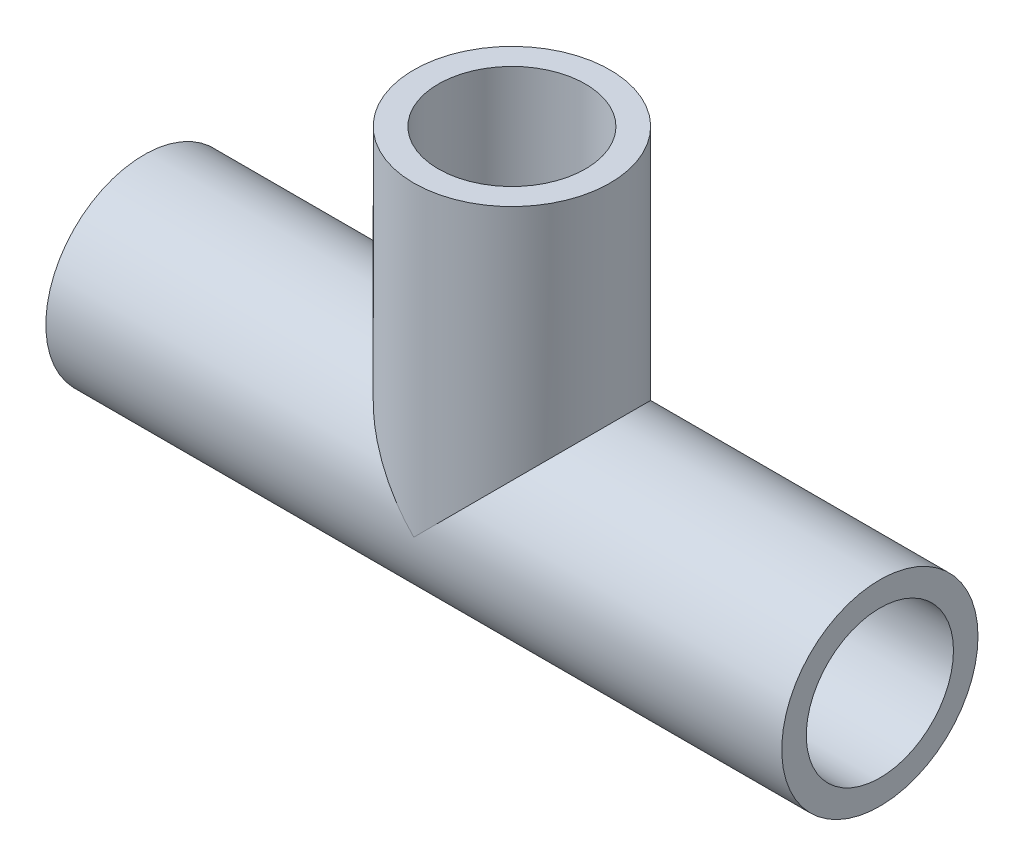
ISO-10303-21;
HEADER;
FILE_DESCRIPTION(('STEP AP214'),'2;1');
FILE_NAME('part.step','',(''),(''),'','','');
FILE_SCHEMA(('AUTOMOTIVE_DESIGN { 1 0 10303 214 1 1 1 1 }'));
ENDSEC;
DATA;
#1=APPLICATION_CONTEXT('core data for automotive mechanical design processes');
#2=APPLICATION_PROTOCOL_DEFINITION('international standard','automotive_design',2000,#1);
#3=PRODUCT_CONTEXT('',#1,'mechanical');
#4=PRODUCT('Part','Part','',(#3));
#5=PRODUCT_RELATED_PRODUCT_CATEGORY('part','',(#4));
#6=PRODUCT_DEFINITION_FORMATION('','',#4);
#7=PRODUCT_DEFINITION_CONTEXT('part definition',#1,'design');
#8=PRODUCT_DEFINITION('design','',#6,#7);
#9=PRODUCT_DEFINITION_SHAPE('','',#8);
#10=(LENGTH_UNIT() NAMED_UNIT(*) SI_UNIT(.MILLI.,.METRE.));
#11=(NAMED_UNIT(*) PLANE_ANGLE_UNIT() SI_UNIT($,.RADIAN.));
#12=(NAMED_UNIT(*) SI_UNIT($,.STERADIAN.) SOLID_ANGLE_UNIT());
#13=UNCERTAINTY_MEASURE_WITH_UNIT(LENGTH_MEASURE(1.E-05),#10,'distance_accuracy_value','');
#14=(GEOMETRIC_REPRESENTATION_CONTEXT(3) GLOBAL_UNCERTAINTY_ASSIGNED_CONTEXT((#13)) GLOBAL_UNIT_ASSIGNED_CONTEXT((#10,
#11,#12)) REPRESENTATION_CONTEXT('',''));
#15=CARTESIAN_POINT('',(0.,0.,0.));
#16=DIRECTION('',(0.,0.,1.));
#17=DIRECTION('',(1.,0.,0.));
#18=AXIS2_PLACEMENT_3D('',#15,#16,#17);
#19=CARTESIAN_POINT('',(30.,0.,0.));
#20=DIRECTION('',(1.,0.,0.));
#21=DIRECTION('',(0.,0.,-1.));
#22=AXIS2_PLACEMENT_3D('',#19,#20,#21);
#23=PLANE('',#22);
#24=CARTESIAN_POINT('',(30.,0.,0.));
#25=DIRECTION('',(1.,0.,0.));
#26=DIRECTION('',(0.,0.,-1.));
#27=AXIS2_PLACEMENT_3D('',#24,#25,#26);
#28=CIRCLE('',#27,8.);
#29=CARTESIAN_POINT('',(30.,0.,-8.));
#30=VERTEX_POINT('',#29);
#31=EDGE_CURVE('E11',#30,#30,#28,.T.);
#32=ORIENTED_EDGE('',*,*,#31,.T.);
#33=EDGE_LOOP('',(#32));
#34=FACE_BOUND('',#33,.T.);
#35=CARTESIAN_POINT('',(30.,0.,0.));
#36=DIRECTION('',(1.,0.,0.));
#37=DIRECTION('',(0.,0.,-1.));
#38=AXIS2_PLACEMENT_3D('',#35,#36,#37);
#39=CIRCLE('',#38,6.);
#40=CARTESIAN_POINT('',(30.,0.,-6.));
#41=VERTEX_POINT('',#40);
#42=EDGE_CURVE('E89',#41,#41,#39,.T.);
#43=ORIENTED_EDGE('',*,*,#42,.F.);
#44=EDGE_LOOP('',(#43));
#45=FACE_BOUND('',#44,.T.);
#46=ADVANCED_FACE('F39',(#34,#45),#23,.T.);
#47=CARTESIAN_POINT('',(-30.,0.,0.));
#48=DIRECTION('',(1.,0.,0.));
#49=DIRECTION('',(0.,0.,-1.));
#50=AXIS2_PLACEMENT_3D('',#47,#48,#49);
#51=PLANE('',#50);
#52=CARTESIAN_POINT('',(-30.,0.,0.));
#53=DIRECTION('',(1.,0.,0.));
#54=DIRECTION('',(0.,0.,-1.));
#55=AXIS2_PLACEMENT_3D('',#52,#53,#54);
#56=CIRCLE('',#55,8.);
#57=CARTESIAN_POINT('',(-30.,0.,-8.));
#58=VERTEX_POINT('',#57);
#59=EDGE_CURVE('E43',#58,#58,#56,.T.);
#60=ORIENTED_EDGE('',*,*,#59,.F.);
#61=EDGE_LOOP('',(#60));
#62=FACE_BOUND('',#61,.T.);
#63=CARTESIAN_POINT('',(-30.,0.,0.));
#64=DIRECTION('',(1.,0.,0.));
#65=DIRECTION('',(0.,0.,-1.));
#66=AXIS2_PLACEMENT_3D('',#63,#64,#65);
#67=CIRCLE('',#66,6.);
#68=CARTESIAN_POINT('',(-30.,0.,-6.));
#69=VERTEX_POINT('',#68);
#70=EDGE_CURVE('E87',#69,#69,#67,.T.);
#71=ORIENTED_EDGE('',*,*,#70,.T.);
#72=EDGE_LOOP('',(#71));
#73=FACE_BOUND('',#72,.T.);
#74=ADVANCED_FACE('F97',(#62,#73),#51,.F.);
#75=CARTESIAN_POINT('',(30.,0.,0.));
#76=DIRECTION('',(-1.,0.,0.));
#77=DIRECTION('',(0.,0.,1.));
#78=AXIS2_PLACEMENT_3D('',#75,#76,#77);
#79=CYLINDRICAL_SURFACE('',#78,8.);
#80=CARTESIAN_POINT('',(0.,0.,0.));
#81=DIRECTION('',(0.707106781186547,0.707106781186547,0.));
#82=DIRECTION('',(-0.707106781186547,0.707106781186547,0.));
#83=AXIS2_PLACEMENT_3D('',#80,#81,#82);
#84=ELLIPSE('',#83,11.3137084989848,8.);
#85=CARTESIAN_POINT('',(0.,0.,-8.));
#86=VERTEX_POINT('',#85);
#87=CARTESIAN_POINT('',(0.,0.,8.));
#88=VERTEX_POINT('',#87);
#89=EDGE_CURVE('E76',#86,#88,#84,.T.);
#90=ORIENTED_EDGE('',*,*,#89,.F.);
#91=CARTESIAN_POINT('',(0.,0.,0.));
#92=DIRECTION('',(-0.707106781186547,0.707106781186547,0.));
#93=DIRECTION('',(0.707106781186547,0.707106781186547,0.));
#94=AXIS2_PLACEMENT_3D('',#91,#92,#93);
#95=ELLIPSE('',#94,11.3137084989848,8.);
#96=EDGE_CURVE('E61',#88,#86,#95,.T.);
#97=ORIENTED_EDGE('',*,*,#96,.F.);
#98=EDGE_LOOP('',(#90,#97));
#99=FACE_BOUND('',#98,.T.);
#100=ORIENTED_EDGE('',*,*,#31,.F.);
#101=EDGE_LOOP('',(#100));
#102=FACE_BOUND('',#101,.T.);
#103=ORIENTED_EDGE('',*,*,#59,.T.);
#104=EDGE_LOOP('',(#103));
#105=FACE_BOUND('',#104,.T.);
#106=ADVANCED_FACE('F41',(#99,#102,#105),#79,.T.);
#107=CARTESIAN_POINT('',(30.,0.,0.));
#108=DIRECTION('',(-1.,0.,0.));
#109=DIRECTION('',(0.,0.,1.));
#110=AXIS2_PLACEMENT_3D('',#107,#108,#109);
#111=CYLINDRICAL_SURFACE('',#110,6.);
#112=CARTESIAN_POINT('',(0.,0.,0.));
#113=DIRECTION('',(-0.707106781186547,0.707106781186547,0.));
#114=DIRECTION('',(-0.707106781186547,-0.707106781186547,0.));
#115=AXIS2_PLACEMENT_3D('',#112,#113,#114);
#116=ELLIPSE('',#115,8.48528137423857,6.);
#117=CARTESIAN_POINT('',(0.,0.,-6.));
#118=VERTEX_POINT('',#117);
#119=CARTESIAN_POINT('',(0.,0.,6.));
#120=VERTEX_POINT('',#119);
#121=EDGE_CURVE('E54',#118,#120,#116,.F.);
#122=ORIENTED_EDGE('',*,*,#121,.F.);
#123=CARTESIAN_POINT('',(0.,0.,0.));
#124=DIRECTION('',(-0.707106781186547,-0.707106781186547,0.));
#125=DIRECTION('',(-0.707106781186547,0.707106781186547,0.));
#126=AXIS2_PLACEMENT_3D('',#123,#124,#125);
#127=ELLIPSE('',#126,8.48528137423857,6.);
#128=EDGE_CURVE('E66',#120,#118,#127,.T.);
#129=ORIENTED_EDGE('',*,*,#128,.F.);
#130=EDGE_LOOP('',(#122,#129));
#131=FACE_BOUND('',#130,.T.);
#132=ORIENTED_EDGE('',*,*,#42,.T.);
#133=EDGE_LOOP('',(#132));
#134=FACE_BOUND('',#133,.T.);
#135=ORIENTED_EDGE('',*,*,#70,.F.);
#136=EDGE_LOOP('',(#135));
#137=FACE_BOUND('',#136,.T.);
#138=ADVANCED_FACE('F73',(#131,#134,#137),#111,.F.);
#139=CARTESIAN_POINT('',(0.,-8.001,0.));
#140=DIRECTION('',(0.,1.,0.));
#141=DIRECTION('',(0.,0.,1.));
#142=AXIS2_PLACEMENT_3D('',#139,#140,#141);
#143=CYLINDRICAL_SURFACE('',#142,8.);
#144=CARTESIAN_POINT('',(0.,25.,0.));
#145=DIRECTION('',(0.,1.,0.));
#146=DIRECTION('',(0.,0.,1.));
#147=AXIS2_PLACEMENT_3D('',#144,#145,#146);
#148=CIRCLE('',#147,8.);
#149=CARTESIAN_POINT('',(0.,25.,8.));
#150=VERTEX_POINT('',#149);
#151=EDGE_CURVE('E84',#150,#150,#148,.T.);
#152=ORIENTED_EDGE('',*,*,#151,.F.);
#153=EDGE_LOOP('',(#152));
#154=FACE_BOUND('',#153,.T.);
#155=ORIENTED_EDGE('',*,*,#89,.T.);
#156=ORIENTED_EDGE('',*,*,#96,.T.);
#157=EDGE_LOOP('',(#155,#156));
#158=FACE_BOUND('',#157,.T.);
#159=ADVANCED_FACE('F100',(#154,#158),#143,.T.);
#160=CARTESIAN_POINT('',(0.,25.,0.));
#161=DIRECTION('',(0.,1.,0.));
#162=DIRECTION('',(0.,0.,1.));
#163=AXIS2_PLACEMENT_3D('',#160,#161,#162);
#164=PLANE('',#163);
#165=CARTESIAN_POINT('',(0.,25.,0.));
#166=DIRECTION('',(0.,1.,0.));
#167=DIRECTION('',(0.,0.,1.));
#168=AXIS2_PLACEMENT_3D('',#165,#166,#167);
#169=CIRCLE('',#168,6.);
#170=CARTESIAN_POINT('',(0.,25.,6.));
#171=VERTEX_POINT('',#170);
#172=EDGE_CURVE('E71',#171,#171,#169,.T.);
#173=ORIENTED_EDGE('',*,*,#172,.F.);
#174=EDGE_LOOP('',(#173));
#175=FACE_BOUND('',#174,.T.);
#176=ORIENTED_EDGE('',*,*,#151,.T.);
#177=EDGE_LOOP('',(#176));
#178=FACE_BOUND('',#177,.T.);
#179=ADVANCED_FACE('F106',(#175,#178),#164,.T.);
#180=CARTESIAN_POINT('',(0.,0.,0.));
#181=DIRECTION('',(0.,1.,0.));
#182=DIRECTION('',(0.,0.,1.));
#183=AXIS2_PLACEMENT_3D('',#180,#181,#182);
#184=CYLINDRICAL_SURFACE('',#183,6.);
#185=ORIENTED_EDGE('',*,*,#121,.T.);
#186=ORIENTED_EDGE('',*,*,#128,.T.);
#187=EDGE_LOOP('',(#185,#186));
#188=FACE_BOUND('',#187,.T.);
#189=ORIENTED_EDGE('',*,*,#172,.T.);
#190=EDGE_LOOP('',(#189));
#191=FACE_BOUND('',#190,.T.);
#192=ADVANCED_FACE('F67',(#188,#191),#184,.F.);
#193=CLOSED_SHELL('',(#46,#74,#106,#138,#159,#179,#192));
#194=MANIFOLD_SOLID_BREP('B2',#193);
#195=ADVANCED_BREP_SHAPE_REPRESENTATION('',(#18,#194),#14);
#196=SHAPE_DEFINITION_REPRESENTATION(#9,#195);
ENDSEC;
END-ISO-10303-21;
